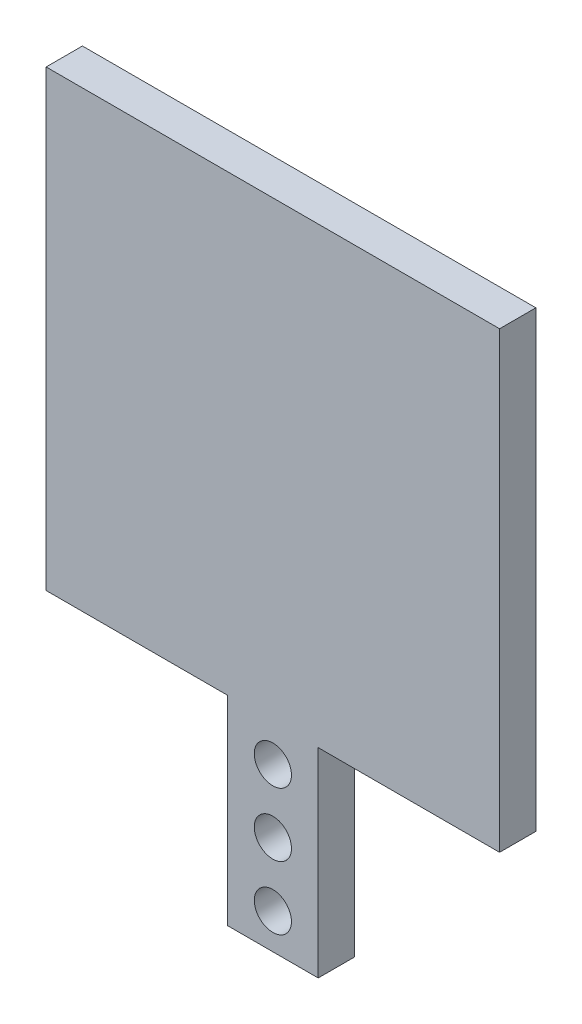
ISO-10303-21;
HEADER;
FILE_DESCRIPTION(('STEP AP214'),'2;1');
FILE_NAME('part.step','',(''),(''),'','','');
FILE_SCHEMA(('AUTOMOTIVE_DESIGN { 1 0 10303 214 1 1 1 1 }'));
ENDSEC;
DATA;
#1=APPLICATION_CONTEXT('core data for automotive mechanical design processes');
#2=APPLICATION_PROTOCOL_DEFINITION('international standard','automotive_design',2000,#1);
#3=PRODUCT_CONTEXT('',#1,'mechanical');
#4=PRODUCT('Part','Part','',(#3));
#5=PRODUCT_RELATED_PRODUCT_CATEGORY('part','',(#4));
#6=PRODUCT_DEFINITION_FORMATION('','',#4);
#7=PRODUCT_DEFINITION_CONTEXT('part definition',#1,'design');
#8=PRODUCT_DEFINITION('design','',#6,#7);
#9=PRODUCT_DEFINITION_SHAPE('','',#8);
#10=(LENGTH_UNIT() NAMED_UNIT(*) SI_UNIT(.MILLI.,.METRE.));
#11=(NAMED_UNIT(*) PLANE_ANGLE_UNIT() SI_UNIT($,.RADIAN.));
#12=(NAMED_UNIT(*) SI_UNIT($,.STERADIAN.) SOLID_ANGLE_UNIT());
#13=UNCERTAINTY_MEASURE_WITH_UNIT(LENGTH_MEASURE(1.E-05),#10,'distance_accuracy_value','');
#14=(GEOMETRIC_REPRESENTATION_CONTEXT(3) GLOBAL_UNCERTAINTY_ASSIGNED_CONTEXT((#13)) GLOBAL_UNIT_ASSIGNED_CONTEXT((#10,
#11,#12)) REPRESENTATION_CONTEXT('',''));
#15=CARTESIAN_POINT('',(0.,0.,0.));
#16=DIRECTION('',(0.,0.,1.));
#17=DIRECTION('',(1.,0.,0.));
#18=AXIS2_PLACEMENT_3D('',#15,#16,#17);
#19=CARTESIAN_POINT('',(0.,0.,4.));
#20=DIRECTION('',(0.,0.,-1.));
#21=DIRECTION('',(-1.,0.,0.));
#22=AXIS2_PLACEMENT_3D('',#19,#20,#21);
#23=PLANE('',#22);
#24=DIRECTION('',(0.,-1.,0.));
#25=VECTOR('',#24,1.);
#26=CARTESIAN_POINT('',(0.,0.,4.));
#27=LINE('',#26,#25);
#28=CARTESIAN_POINT('',(0.,50.,4.));
#29=VERTEX_POINT('',#28);
#30=CARTESIAN_POINT('',(0.,0.,4.));
#31=VERTEX_POINT('',#30);
#32=EDGE_CURVE('E145',#29,#31,#27,.T.);
#33=ORIENTED_EDGE('',*,*,#32,.T.);
#34=DIRECTION('',(1.,0.,0.));
#35=VECTOR('',#34,1.);
#36=CARTESIAN_POINT('',(0.,0.,4.));
#37=LINE('',#36,#35);
#38=CARTESIAN_POINT('',(20.,0.,4.));
#39=VERTEX_POINT('',#38);
#40=EDGE_CURVE('E93',#31,#39,#37,.T.);
#41=ORIENTED_EDGE('',*,*,#40,.T.);
#42=DIRECTION('',(0.,-1.,0.));
#43=VECTOR('',#42,1.);
#44=CARTESIAN_POINT('',(20.,0.,4.));
#45=LINE('',#44,#43);
#46=CARTESIAN_POINT('',(20.,-22.,4.));
#47=VERTEX_POINT('',#46);
#48=EDGE_CURVE('E160',#39,#47,#45,.T.);
#49=ORIENTED_EDGE('',*,*,#48,.T.);
#50=DIRECTION('',(1.,0.,0.));
#51=VECTOR('',#50,1.);
#52=CARTESIAN_POINT('',(20.,-22.,4.));
#53=LINE('',#52,#51);
#54=CARTESIAN_POINT('',(30.,-22.,4.));
#55=VERTEX_POINT('',#54);
#56=EDGE_CURVE('E173',#47,#55,#53,.T.);
#57=ORIENTED_EDGE('',*,*,#56,.T.);
#58=DIRECTION('',(0.,1.,0.));
#59=VECTOR('',#58,1.);
#60=CARTESIAN_POINT('',(30.,0.,4.));
#61=LINE('',#60,#59);
#62=CARTESIAN_POINT('',(30.,0.,4.));
#63=VERTEX_POINT('',#62);
#64=EDGE_CURVE('E112',#55,#63,#61,.T.);
#65=ORIENTED_EDGE('',*,*,#64,.T.);
#66=DIRECTION('',(1.,0.,0.));
#67=VECTOR('',#66,1.);
#68=CARTESIAN_POINT('',(30.,0.,4.));
#69=LINE('',#68,#67);
#70=CARTESIAN_POINT('',(50.,0.,4.));
#71=VERTEX_POINT('',#70);
#72=EDGE_CURVE('E106',#63,#71,#69,.T.);
#73=ORIENTED_EDGE('',*,*,#72,.T.);
#74=DIRECTION('',(0.,1.,0.));
#75=VECTOR('',#74,1.);
#76=CARTESIAN_POINT('',(50.,0.,4.));
#77=LINE('',#76,#75);
#78=CARTESIAN_POINT('',(50.,50.,4.));
#79=VERTEX_POINT('',#78);
#80=EDGE_CURVE('E110',#71,#79,#77,.T.);
#81=ORIENTED_EDGE('',*,*,#80,.T.);
#82=DIRECTION('',(-1.,0.,0.));
#83=VECTOR('',#82,1.);
#84=CARTESIAN_POINT('',(0.,50.,4.));
#85=LINE('',#84,#83);
#86=EDGE_CURVE('E50',#79,#29,#85,.T.);
#87=ORIENTED_EDGE('',*,*,#86,.T.);
#88=EDGE_LOOP('',(#33,#41,#49,#57,#65,#73,#81,#87));
#89=FACE_BOUND('',#88,.T.);
#90=CARTESIAN_POINT('',(25.,-18.1,4.));
#91=DIRECTION('',(0.,0.,1.));
#92=DIRECTION('',(1.,0.,0.));
#93=AXIS2_PLACEMENT_3D('',#90,#91,#92);
#94=CIRCLE('',#93,2.05);
#95=CARTESIAN_POINT('',(27.05,-18.1,4.));
#96=VERTEX_POINT('',#95);
#97=EDGE_CURVE('E134',#96,#96,#94,.T.);
#98=ORIENTED_EDGE('',*,*,#97,.F.);
#99=EDGE_LOOP('',(#98));
#100=FACE_BOUND('',#99,.T.);
#101=CARTESIAN_POINT('',(25.,-11.1,4.));
#102=DIRECTION('',(0.,0.,1.));
#103=DIRECTION('',(1.,0.,0.));
#104=AXIS2_PLACEMENT_3D('',#101,#102,#103);
#105=CIRCLE('',#104,2.05);
#106=CARTESIAN_POINT('',(27.05,-11.1,4.));
#107=VERTEX_POINT('',#106);
#108=EDGE_CURVE('E182',#107,#107,#105,.T.);
#109=ORIENTED_EDGE('',*,*,#108,.F.);
#110=EDGE_LOOP('',(#109));
#111=FACE_BOUND('',#110,.T.);
#112=CARTESIAN_POINT('',(25.,-4.1,4.));
#113=DIRECTION('',(0.,0.,1.));
#114=DIRECTION('',(1.,0.,0.));
#115=AXIS2_PLACEMENT_3D('',#112,#113,#114);
#116=CIRCLE('',#115,2.05);
#117=CARTESIAN_POINT('',(27.05,-4.1,4.));
#118=VERTEX_POINT('',#117);
#119=EDGE_CURVE('E188',#118,#118,#116,.T.);
#120=ORIENTED_EDGE('',*,*,#119,.F.);
#121=EDGE_LOOP('',(#120));
#122=FACE_BOUND('',#121,.T.);
#123=ADVANCED_FACE('F33',(#89,#100,#111,#122),#23,.F.);
#124=CARTESIAN_POINT('',(0.,0.,0.));
#125=DIRECTION('',(0.,0.,-1.));
#126=DIRECTION('',(-1.,0.,0.));
#127=AXIS2_PLACEMENT_3D('',#124,#125,#126);
#128=PLANE('',#127);
#129=CARTESIAN_POINT('',(25.,-11.1,0.));
#130=DIRECTION('',(0.,0.,1.));
#131=DIRECTION('',(1.,0.,0.));
#132=AXIS2_PLACEMENT_3D('',#129,#130,#131);
#133=CIRCLE('',#132,2.05);
#134=CARTESIAN_POINT('',(27.05,-11.1,0.));
#135=VERTEX_POINT('',#134);
#136=EDGE_CURVE('E185',#135,#135,#133,.T.);
#137=ORIENTED_EDGE('',*,*,#136,.T.);
#138=EDGE_LOOP('',(#137));
#139=FACE_BOUND('',#138,.T.);
#140=DIRECTION('',(0.,-1.,0.));
#141=VECTOR('',#140,1.);
#142=CARTESIAN_POINT('',(0.,0.,0.));
#143=LINE('',#142,#141);
#144=CARTESIAN_POINT('',(0.,50.,0.));
#145=VERTEX_POINT('',#144);
#146=CARTESIAN_POINT('',(0.,0.,0.));
#147=VERTEX_POINT('',#146);
#148=EDGE_CURVE('E130',#145,#147,#143,.T.);
#149=ORIENTED_EDGE('',*,*,#148,.F.);
#150=DIRECTION('',(-1.,0.,0.));
#151=VECTOR('',#150,1.);
#152=CARTESIAN_POINT('',(0.,50.,0.));
#153=LINE('',#152,#151);
#154=CARTESIAN_POINT('',(50.,50.,0.));
#155=VERTEX_POINT('',#154);
#156=EDGE_CURVE('E85',#155,#145,#153,.T.);
#157=ORIENTED_EDGE('',*,*,#156,.F.);
#158=DIRECTION('',(0.,1.,0.));
#159=VECTOR('',#158,1.);
#160=CARTESIAN_POINT('',(50.,0.,0.));
#161=LINE('',#160,#159);
#162=CARTESIAN_POINT('',(50.,0.,0.));
#163=VERTEX_POINT('',#162);
#164=EDGE_CURVE('E79',#163,#155,#161,.T.);
#165=ORIENTED_EDGE('',*,*,#164,.F.);
#166=DIRECTION('',(1.,0.,0.));
#167=VECTOR('',#166,1.);
#168=CARTESIAN_POINT('',(30.,0.,0.));
#169=LINE('',#168,#167);
#170=CARTESIAN_POINT('',(30.,0.,0.));
#171=VERTEX_POINT('',#170);
#172=EDGE_CURVE('E120',#171,#163,#169,.T.);
#173=ORIENTED_EDGE('',*,*,#172,.F.);
#174=DIRECTION('',(0.,1.,0.));
#175=VECTOR('',#174,1.);
#176=CARTESIAN_POINT('',(30.,0.,0.));
#177=LINE('',#176,#175);
#178=CARTESIAN_POINT('',(30.,-22.,0.));
#179=VERTEX_POINT('',#178);
#180=EDGE_CURVE('E140',#179,#171,#177,.T.);
#181=ORIENTED_EDGE('',*,*,#180,.F.);
#182=DIRECTION('',(1.,0.,0.));
#183=VECTOR('',#182,1.);
#184=CARTESIAN_POINT('',(20.,-22.,0.));
#185=LINE('',#184,#183);
#186=CARTESIAN_POINT('',(20.,-22.,0.));
#187=VERTEX_POINT('',#186);
#188=EDGE_CURVE('E138',#187,#179,#185,.T.);
#189=ORIENTED_EDGE('',*,*,#188,.F.);
#190=DIRECTION('',(0.,-1.,0.));
#191=VECTOR('',#190,1.);
#192=CARTESIAN_POINT('',(20.,0.,0.));
#193=LINE('',#192,#191);
#194=CARTESIAN_POINT('',(20.,0.,0.));
#195=VERTEX_POINT('',#194);
#196=EDGE_CURVE('E136',#195,#187,#193,.T.);
#197=ORIENTED_EDGE('',*,*,#196,.F.);
#198=DIRECTION('',(1.,0.,0.));
#199=VECTOR('',#198,1.);
#200=CARTESIAN_POINT('',(0.,0.,0.));
#201=LINE('',#200,#199);
#202=EDGE_CURVE('E133',#147,#195,#201,.T.);
#203=ORIENTED_EDGE('',*,*,#202,.F.);
#204=EDGE_LOOP('',(#149,#157,#165,#173,#181,#189,#197,#203));
#205=FACE_BOUND('',#204,.T.);
#206=CARTESIAN_POINT('',(25.,-18.1,0.));
#207=DIRECTION('',(0.,0.,1.));
#208=DIRECTION('',(1.,0.,0.));
#209=AXIS2_PLACEMENT_3D('',#206,#207,#208);
#210=CIRCLE('',#209,2.05);
#211=CARTESIAN_POINT('',(27.05,-18.1,0.));
#212=VERTEX_POINT('',#211);
#213=EDGE_CURVE('E179',#212,#212,#210,.T.);
#214=ORIENTED_EDGE('',*,*,#213,.T.);
#215=EDGE_LOOP('',(#214));
#216=FACE_BOUND('',#215,.T.);
#217=CARTESIAN_POINT('',(25.,-4.1,0.));
#218=DIRECTION('',(0.,0.,1.));
#219=DIRECTION('',(1.,0.,0.));
#220=AXIS2_PLACEMENT_3D('',#217,#218,#219);
#221=CIRCLE('',#220,2.05);
#222=CARTESIAN_POINT('',(27.05,-4.1,0.));
#223=VERTEX_POINT('',#222);
#224=EDGE_CURVE('E191',#223,#223,#221,.T.);
#225=ORIENTED_EDGE('',*,*,#224,.T.);
#226=EDGE_LOOP('',(#225));
#227=FACE_BOUND('',#226,.T.);
#228=ADVANCED_FACE('F164',(#139,#205,#216,#227),#128,.T.);
#229=CARTESIAN_POINT('',(0.,0.,4.));
#230=DIRECTION('',(1.,0.,0.));
#231=DIRECTION('',(0.,0.,-1.));
#232=AXIS2_PLACEMENT_3D('',#229,#230,#231);
#233=PLANE('',#232);
#234=ORIENTED_EDGE('',*,*,#148,.T.);
#235=DIRECTION('',(0.,0.,-1.));
#236=VECTOR('',#235,1.);
#237=CARTESIAN_POINT('',(0.,0.,4.));
#238=LINE('',#237,#236);
#239=EDGE_CURVE('E11',#31,#147,#238,.T.);
#240=ORIENTED_EDGE('',*,*,#239,.F.);
#241=ORIENTED_EDGE('',*,*,#32,.F.);
#242=DIRECTION('',(0.,0.,-1.));
#243=VECTOR('',#242,1.);
#244=CARTESIAN_POINT('',(0.,50.,4.));
#245=LINE('',#244,#243);
#246=EDGE_CURVE('E126',#29,#145,#245,.T.);
#247=ORIENTED_EDGE('',*,*,#246,.T.);
#248=EDGE_LOOP('',(#234,#240,#241,#247));
#249=FACE_BOUND('',#248,.T.);
#250=ADVANCED_FACE('F35',(#249),#233,.F.);
#251=CARTESIAN_POINT('',(0.,0.,4.));
#252=DIRECTION('',(0.,1.,0.));
#253=DIRECTION('',(0.,0.,1.));
#254=AXIS2_PLACEMENT_3D('',#251,#252,#253);
#255=PLANE('',#254);
#256=ORIENTED_EDGE('',*,*,#202,.T.);
#257=DIRECTION('',(0.,0.,-1.));
#258=VECTOR('',#257,1.);
#259=CARTESIAN_POINT('',(20.,0.,4.));
#260=LINE('',#259,#258);
#261=EDGE_CURVE('E42',#39,#195,#260,.T.);
#262=ORIENTED_EDGE('',*,*,#261,.F.);
#263=ORIENTED_EDGE('',*,*,#40,.F.);
#264=ORIENTED_EDGE('',*,*,#239,.T.);
#265=EDGE_LOOP('',(#256,#262,#263,#264));
#266=FACE_BOUND('',#265,.T.);
#267=ADVANCED_FACE('F223',(#266),#255,.F.);
#268=CARTESIAN_POINT('',(20.,0.,4.));
#269=DIRECTION('',(1.,0.,0.));
#270=DIRECTION('',(0.,1.,0.));
#271=AXIS2_PLACEMENT_3D('',#268,#269,#270);
#272=PLANE('',#271);
#273=ORIENTED_EDGE('',*,*,#196,.T.);
#274=DIRECTION('',(0.,0.,-1.));
#275=VECTOR('',#274,1.);
#276=CARTESIAN_POINT('',(20.,-22.,4.));
#277=LINE('',#276,#275);
#278=EDGE_CURVE('E152',#47,#187,#277,.T.);
#279=ORIENTED_EDGE('',*,*,#278,.F.);
#280=ORIENTED_EDGE('',*,*,#48,.F.);
#281=ORIENTED_EDGE('',*,*,#261,.T.);
#282=EDGE_LOOP('',(#273,#279,#280,#281));
#283=FACE_BOUND('',#282,.T.);
#284=ADVANCED_FACE('F158',(#283),#272,.F.);
#285=CARTESIAN_POINT('',(20.,-22.,4.));
#286=DIRECTION('',(0.,1.,0.));
#287=DIRECTION('',(0.,0.,1.));
#288=AXIS2_PLACEMENT_3D('',#285,#286,#287);
#289=PLANE('',#288);
#290=ORIENTED_EDGE('',*,*,#188,.T.);
#291=DIRECTION('',(0.,0.,-1.));
#292=VECTOR('',#291,1.);
#293=CARTESIAN_POINT('',(30.,-22.,4.));
#294=LINE('',#293,#292);
#295=EDGE_CURVE('E149',#55,#179,#294,.T.);
#296=ORIENTED_EDGE('',*,*,#295,.F.);
#297=ORIENTED_EDGE('',*,*,#56,.F.);
#298=ORIENTED_EDGE('',*,*,#278,.T.);
#299=EDGE_LOOP('',(#290,#296,#297,#298));
#300=FACE_BOUND('',#299,.T.);
#301=ADVANCED_FACE('F169',(#300),#289,.F.);
#302=CARTESIAN_POINT('',(30.,0.,4.));
#303=DIRECTION('',(-1.,0.,0.));
#304=DIRECTION('',(0.,-1.,0.));
#305=AXIS2_PLACEMENT_3D('',#302,#303,#304);
#306=PLANE('',#305);
#307=ORIENTED_EDGE('',*,*,#180,.T.);
#308=DIRECTION('',(0.,0.,-1.));
#309=VECTOR('',#308,1.);
#310=CARTESIAN_POINT('',(30.,0.,4.));
#311=LINE('',#310,#309);
#312=EDGE_CURVE('E121',#63,#171,#311,.T.);
#313=ORIENTED_EDGE('',*,*,#312,.F.);
#314=ORIENTED_EDGE('',*,*,#64,.F.);
#315=ORIENTED_EDGE('',*,*,#295,.T.);
#316=EDGE_LOOP('',(#307,#313,#314,#315));
#317=FACE_BOUND('',#316,.T.);
#318=ADVANCED_FACE('F172',(#317),#306,.F.);
#319=CARTESIAN_POINT('',(30.,0.,4.));
#320=DIRECTION('',(0.,1.,0.));
#321=DIRECTION('',(0.,0.,1.));
#322=AXIS2_PLACEMENT_3D('',#319,#320,#321);
#323=PLANE('',#322);
#324=ORIENTED_EDGE('',*,*,#172,.T.);
#325=DIRECTION('',(0.,0.,-1.));
#326=VECTOR('',#325,1.);
#327=CARTESIAN_POINT('',(50.,0.,4.));
#328=LINE('',#327,#326);
#329=EDGE_CURVE('E117',#71,#163,#328,.T.);
#330=ORIENTED_EDGE('',*,*,#329,.F.);
#331=ORIENTED_EDGE('',*,*,#72,.F.);
#332=ORIENTED_EDGE('',*,*,#312,.T.);
#333=EDGE_LOOP('',(#324,#330,#331,#332));
#334=FACE_BOUND('',#333,.T.);
#335=ADVANCED_FACE('F118',(#334),#323,.F.);
#336=CARTESIAN_POINT('',(50.,0.,4.));
#337=DIRECTION('',(-1.,0.,0.));
#338=DIRECTION('',(0.,0.,1.));
#339=AXIS2_PLACEMENT_3D('',#336,#337,#338);
#340=PLANE('',#339);
#341=ORIENTED_EDGE('',*,*,#164,.T.);
#342=DIRECTION('',(0.,0.,-1.));
#343=VECTOR('',#342,1.);
#344=CARTESIAN_POINT('',(50.,50.,4.));
#345=LINE('',#344,#343);
#346=EDGE_CURVE('E122',#79,#155,#345,.T.);
#347=ORIENTED_EDGE('',*,*,#346,.F.);
#348=ORIENTED_EDGE('',*,*,#80,.F.);
#349=ORIENTED_EDGE('',*,*,#329,.T.);
#350=EDGE_LOOP('',(#341,#347,#348,#349));
#351=FACE_BOUND('',#350,.T.);
#352=ADVANCED_FACE('F124',(#351),#340,.F.);
#353=CARTESIAN_POINT('',(0.,50.,4.));
#354=DIRECTION('',(0.,-1.,0.));
#355=DIRECTION('',(0.,0.,-1.));
#356=AXIS2_PLACEMENT_3D('',#353,#354,#355);
#357=PLANE('',#356);
#358=ORIENTED_EDGE('',*,*,#156,.T.);
#359=ORIENTED_EDGE('',*,*,#246,.F.);
#360=ORIENTED_EDGE('',*,*,#86,.F.);
#361=ORIENTED_EDGE('',*,*,#346,.T.);
#362=EDGE_LOOP('',(#358,#359,#360,#361));
#363=FACE_BOUND('',#362,.T.);
#364=ADVANCED_FACE('F211',(#363),#357,.F.);
#365=CARTESIAN_POINT('',(25.,-18.1,4.));
#366=DIRECTION('',(0.,0.,-1.));
#367=DIRECTION('',(-1.,0.,0.));
#368=AXIS2_PLACEMENT_3D('',#365,#366,#367);
#369=CYLINDRICAL_SURFACE('',#368,2.05);
#370=ORIENTED_EDGE('',*,*,#97,.T.);
#371=EDGE_LOOP('',(#370));
#372=FACE_BOUND('',#371,.T.);
#373=ORIENTED_EDGE('',*,*,#213,.F.);
#374=EDGE_LOOP('',(#373));
#375=FACE_BOUND('',#374,.T.);
#376=ADVANCED_FACE('F208',(#372,#375),#369,.F.);
#377=CARTESIAN_POINT('',(25.,-11.1,4.));
#378=DIRECTION('',(0.,0.,-1.));
#379=DIRECTION('',(-1.,0.,0.));
#380=AXIS2_PLACEMENT_3D('',#377,#378,#379);
#381=CYLINDRICAL_SURFACE('',#380,2.05);
#382=ORIENTED_EDGE('',*,*,#108,.T.);
#383=EDGE_LOOP('',(#382));
#384=FACE_BOUND('',#383,.T.);
#385=ORIENTED_EDGE('',*,*,#136,.F.);
#386=EDGE_LOOP('',(#385));
#387=FACE_BOUND('',#386,.T.);
#388=ADVANCED_FACE('F287',(#384,#387),#381,.F.);
#389=CARTESIAN_POINT('',(25.,-4.1,4.));
#390=DIRECTION('',(0.,0.,-1.));
#391=DIRECTION('',(-1.,0.,0.));
#392=AXIS2_PLACEMENT_3D('',#389,#390,#391);
#393=CYLINDRICAL_SURFACE('',#392,2.05);
#394=ORIENTED_EDGE('',*,*,#119,.T.);
#395=EDGE_LOOP('',(#394));
#396=FACE_BOUND('',#395,.T.);
#397=ORIENTED_EDGE('',*,*,#224,.F.);
#398=EDGE_LOOP('',(#397));
#399=FACE_BOUND('',#398,.T.);
#400=ADVANCED_FACE('F197',(#396,#399),#393,.F.);
#401=CLOSED_SHELL('',(#123,#228,#250,#267,#284,#301,#318,#335,#352,#364,#376,#388,#400));
#402=MANIFOLD_SOLID_BREP('B2',#401);
#403=ADVANCED_BREP_SHAPE_REPRESENTATION('',(#18,#402),#14);
#404=SHAPE_DEFINITION_REPRESENTATION(#9,#403);
ENDSEC;
END-ISO-10303-21;
